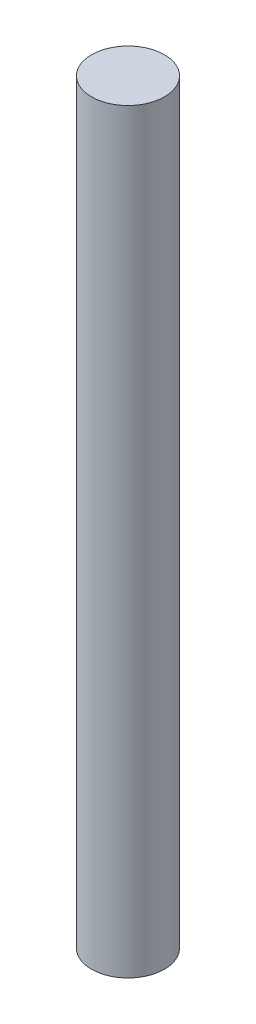
ISO-10303-21;
HEADER;
FILE_DESCRIPTION(('STEP AP214'),'2;1');
FILE_NAME('part.step','',(''),(''),'','','');
FILE_SCHEMA(('AUTOMOTIVE_DESIGN { 1 0 10303 214 1 1 1 1 }'));
ENDSEC;
DATA;
#1=APPLICATION_CONTEXT('core data for automotive mechanical design processes');
#2=APPLICATION_PROTOCOL_DEFINITION('international standard','automotive_design',2000,#1);
#3=PRODUCT_CONTEXT('',#1,'mechanical');
#4=PRODUCT('Part','Part','',(#3));
#5=PRODUCT_RELATED_PRODUCT_CATEGORY('part','',(#4));
#6=PRODUCT_DEFINITION_FORMATION('','',#4);
#7=PRODUCT_DEFINITION_CONTEXT('part definition',#1,'design');
#8=PRODUCT_DEFINITION('design','',#6,#7);
#9=PRODUCT_DEFINITION_SHAPE('','',#8);
#10=(LENGTH_UNIT() NAMED_UNIT(*) SI_UNIT(.MILLI.,.METRE.));
#11=(NAMED_UNIT(*) PLANE_ANGLE_UNIT() SI_UNIT($,.RADIAN.));
#12=(NAMED_UNIT(*) SI_UNIT($,.STERADIAN.) SOLID_ANGLE_UNIT());
#13=UNCERTAINTY_MEASURE_WITH_UNIT(LENGTH_MEASURE(1.E-05),#10,'distance_accuracy_value','');
#14=(GEOMETRIC_REPRESENTATION_CONTEXT(3) GLOBAL_UNCERTAINTY_ASSIGNED_CONTEXT((#13)) GLOBAL_UNIT_ASSIGNED_CONTEXT((#10,
#11,#12)) REPRESENTATION_CONTEXT('',''));
#15=CARTESIAN_POINT('',(0.,0.,0.));
#16=DIRECTION('',(0.,0.,1.));
#17=DIRECTION('',(1.,0.,0.));
#18=AXIS2_PLACEMENT_3D('',#15,#16,#17);
#19=CARTESIAN_POINT('',(0.,145.,0.));
#20=DIRECTION('',(0.,-1.,0.));
#21=DIRECTION('',(0.,0.,-1.));
#22=AXIS2_PLACEMENT_3D('',#19,#20,#21);
#23=CYLINDRICAL_SURFACE('',#22,7.);
#24=CARTESIAN_POINT('',(0.,145.,0.));
#25=DIRECTION('',(0.,1.,0.));
#26=DIRECTION('',(0.,0.,1.));
#27=AXIS2_PLACEMENT_3D('',#24,#25,#26);
#28=CIRCLE('',#27,7.);
#29=CARTESIAN_POINT('',(0.,145.,7.));
#30=VERTEX_POINT('',#29);
#31=EDGE_CURVE('E10',#30,#30,#28,.T.);
#32=ORIENTED_EDGE('',*,*,#31,.F.);
#33=EDGE_LOOP('',(#32));
#34=FACE_BOUND('',#33,.T.);
#35=CARTESIAN_POINT('',(0.,0.,0.));
#36=DIRECTION('',(0.,1.,0.));
#37=DIRECTION('',(0.,0.,1.));
#38=AXIS2_PLACEMENT_3D('',#35,#36,#37);
#39=CIRCLE('',#38,7.);
#40=CARTESIAN_POINT('',(0.,0.,7.));
#41=VERTEX_POINT('',#40);
#42=EDGE_CURVE('E36',#41,#41,#39,.T.);
#43=ORIENTED_EDGE('',*,*,#42,.T.);
#44=EDGE_LOOP('',(#43));
#45=FACE_BOUND('',#44,.T.);
#46=ADVANCED_FACE('F33',(#34,#45),#23,.T.);
#47=CARTESIAN_POINT('',(0.,145.,0.));
#48=DIRECTION('',(0.,1.,0.));
#49=DIRECTION('',(0.,0.,1.));
#50=AXIS2_PLACEMENT_3D('',#47,#48,#49);
#51=PLANE('',#50);
#52=ORIENTED_EDGE('',*,*,#31,.T.);
#53=EDGE_LOOP('',(#52));
#54=FACE_BOUND('',#53,.T.);
#55=ADVANCED_FACE('F48',(#54),#51,.T.);
#56=CARTESIAN_POINT('',(0.,0.,0.));
#57=DIRECTION('',(0.,1.,0.));
#58=DIRECTION('',(0.,0.,1.));
#59=AXIS2_PLACEMENT_3D('',#56,#57,#58);
#60=PLANE('',#59);
#61=ORIENTED_EDGE('',*,*,#42,.F.);
#62=EDGE_LOOP('',(#61));
#63=FACE_BOUND('',#62,.T.);
#64=ADVANCED_FACE('F46',(#63),#60,.F.);
#65=CLOSED_SHELL('',(#46,#55,#64));
#66=MANIFOLD_SOLID_BREP('B2',#65);
#67=ADVANCED_BREP_SHAPE_REPRESENTATION('',(#18,#66),#14);
#68=SHAPE_DEFINITION_REPRESENTATION(#9,#67);
ENDSEC;
END-ISO-10303-21;
